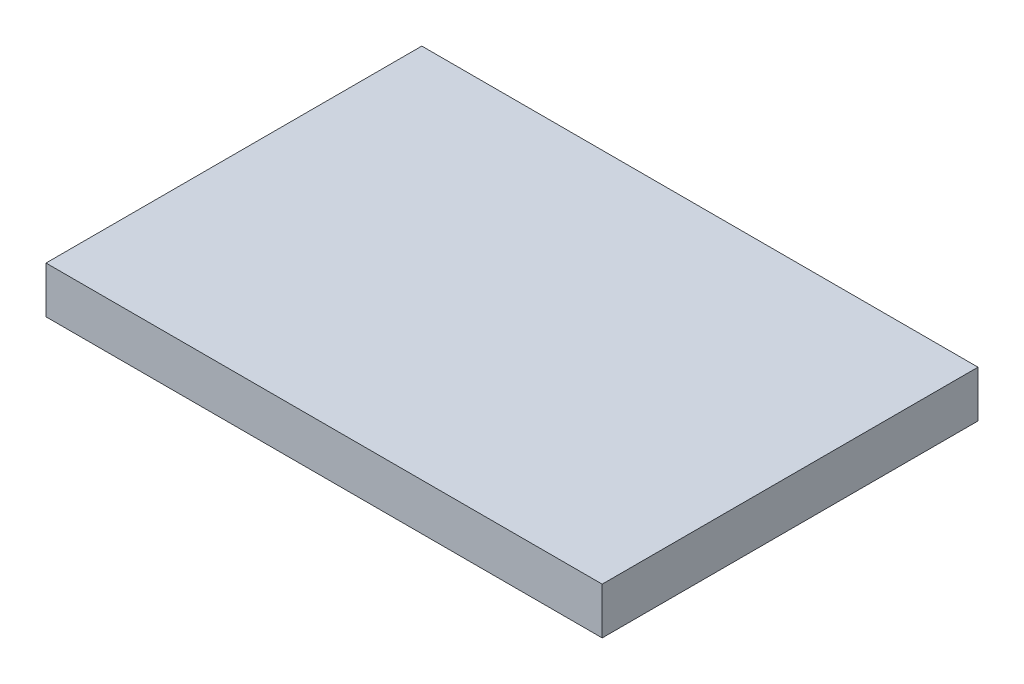
ISO-10303-21;
HEADER;
FILE_DESCRIPTION(('STEP AP214'),'2;1');
FILE_NAME('part.step','',(''),(''),'','','');
FILE_SCHEMA(('AUTOMOTIVE_DESIGN { 1 0 10303 214 1 1 1 1 }'));
ENDSEC;
DATA;
#1=APPLICATION_CONTEXT('core data for automotive mechanical design processes');
#2=APPLICATION_PROTOCOL_DEFINITION('international standard','automotive_design',2000,#1);
#3=PRODUCT_CONTEXT('',#1,'mechanical');
#4=PRODUCT('Part','Part','',(#3));
#5=PRODUCT_RELATED_PRODUCT_CATEGORY('part','',(#4));
#6=PRODUCT_DEFINITION_FORMATION('','',#4);
#7=PRODUCT_DEFINITION_CONTEXT('part definition',#1,'design');
#8=PRODUCT_DEFINITION('design','',#6,#7);
#9=PRODUCT_DEFINITION_SHAPE('','',#8);
#10=(LENGTH_UNIT() NAMED_UNIT(*) SI_UNIT(.MILLI.,.METRE.));
#11=(NAMED_UNIT(*) PLANE_ANGLE_UNIT() SI_UNIT($,.RADIAN.));
#12=(NAMED_UNIT(*) SI_UNIT($,.STERADIAN.) SOLID_ANGLE_UNIT());
#13=UNCERTAINTY_MEASURE_WITH_UNIT(LENGTH_MEASURE(1.E-05),#10,'distance_accuracy_value','');
#14=(GEOMETRIC_REPRESENTATION_CONTEXT(3) GLOBAL_UNCERTAINTY_ASSIGNED_CONTEXT((#13)) GLOBAL_UNIT_ASSIGNED_CONTEXT((#10,
#11,#12)) REPRESENTATION_CONTEXT('',''));
#15=CARTESIAN_POINT('',(0.,0.,0.));
#16=DIRECTION('',(0.,0.,1.));
#17=DIRECTION('',(1.,0.,0.));
#18=AXIS2_PLACEMENT_3D('',#15,#16,#17);
#19=CARTESIAN_POINT('',(-92.5,15.5,62.5));
#20=DIRECTION('',(1.,0.,0.));
#21=DIRECTION('',(0.,0.,-1.));
#22=AXIS2_PLACEMENT_3D('',#19,#20,#21);
#23=PLANE('',#22);
#24=DIRECTION('',(0.,0.,1.));
#25=VECTOR('',#24,1.);
#26=CARTESIAN_POINT('',(-92.5,0.,62.5));
#27=LINE('',#26,#25);
#28=CARTESIAN_POINT('',(-92.5,0.,-62.5));
#29=VERTEX_POINT('',#28);
#30=CARTESIAN_POINT('',(-92.5,0.,62.5));
#31=VERTEX_POINT('',#30);
#32=EDGE_CURVE('E96',#29,#31,#27,.T.);
#33=ORIENTED_EDGE('',*,*,#32,.T.);
#34=DIRECTION('',(0.,-1.,0.));
#35=VECTOR('',#34,1.);
#36=CARTESIAN_POINT('',(-92.5,15.5,62.5));
#37=LINE('',#36,#35);
#38=CARTESIAN_POINT('',(-92.5,15.5,62.5));
#39=VERTEX_POINT('',#38);
#40=EDGE_CURVE('E11',#39,#31,#37,.T.);
#41=ORIENTED_EDGE('',*,*,#40,.F.);
#42=DIRECTION('',(0.,0.,1.));
#43=VECTOR('',#42,1.);
#44=CARTESIAN_POINT('',(-92.5,15.5,62.5));
#45=LINE('',#44,#43);
#46=CARTESIAN_POINT('',(-92.5,15.5,-62.5));
#47=VERTEX_POINT('',#46);
#48=EDGE_CURVE('E84',#47,#39,#45,.T.);
#49=ORIENTED_EDGE('',*,*,#48,.F.);
#50=DIRECTION('',(0.,-1.,0.));
#51=VECTOR('',#50,1.);
#52=CARTESIAN_POINT('',(-92.5,15.5,-62.5));
#53=LINE('',#52,#51);
#54=EDGE_CURVE('E92',#47,#29,#53,.T.);
#55=ORIENTED_EDGE('',*,*,#54,.T.);
#56=EDGE_LOOP('',(#33,#41,#49,#55));
#57=FACE_BOUND('',#56,.T.);
#58=ADVANCED_FACE('F33',(#57),#23,.F.);
#59=CARTESIAN_POINT('',(92.5,15.5,62.5));
#60=DIRECTION('',(0.,0.,-1.));
#61=DIRECTION('',(-1.,0.,0.));
#62=AXIS2_PLACEMENT_3D('',#59,#60,#61);
#63=PLANE('',#62);
#64=DIRECTION('',(1.,0.,0.));
#65=VECTOR('',#64,1.);
#66=CARTESIAN_POINT('',(92.5,0.,62.5));
#67=LINE('',#66,#65);
#68=CARTESIAN_POINT('',(92.5,0.,62.5));
#69=VERTEX_POINT('',#68);
#70=EDGE_CURVE('E88',#31,#69,#67,.T.);
#71=ORIENTED_EDGE('',*,*,#70,.T.);
#72=DIRECTION('',(0.,-1.,0.));
#73=VECTOR('',#72,1.);
#74=CARTESIAN_POINT('',(92.5,15.5,62.5));
#75=LINE('',#74,#73);
#76=CARTESIAN_POINT('',(92.5,15.5,62.5));
#77=VERTEX_POINT('',#76);
#78=EDGE_CURVE('E41',#77,#69,#75,.T.);
#79=ORIENTED_EDGE('',*,*,#78,.F.);
#80=DIRECTION('',(1.,0.,0.));
#81=VECTOR('',#80,1.);
#82=CARTESIAN_POINT('',(92.5,15.5,62.5));
#83=LINE('',#82,#81);
#84=EDGE_CURVE('E79',#39,#77,#83,.T.);
#85=ORIENTED_EDGE('',*,*,#84,.F.);
#86=ORIENTED_EDGE('',*,*,#40,.T.);
#87=EDGE_LOOP('',(#71,#79,#85,#86));
#88=FACE_BOUND('',#87,.T.);
#89=ADVANCED_FACE('F87',(#88),#63,.F.);
#90=CARTESIAN_POINT('',(92.5,15.5,62.5));
#91=DIRECTION('',(-1.,0.,0.));
#92=DIRECTION('',(0.,0.,1.));
#93=AXIS2_PLACEMENT_3D('',#90,#91,#92);
#94=PLANE('',#93);
#95=DIRECTION('',(0.,0.,-1.));
#96=VECTOR('',#95,1.);
#97=CARTESIAN_POINT('',(92.5,0.,62.5));
#98=LINE('',#97,#96);
#99=CARTESIAN_POINT('',(92.5,0.,-62.5));
#100=VERTEX_POINT('',#99);
#101=EDGE_CURVE('E66',#69,#100,#98,.T.);
#102=ORIENTED_EDGE('',*,*,#101,.T.);
#103=DIRECTION('',(0.,-1.,0.));
#104=VECTOR('',#103,1.);
#105=CARTESIAN_POINT('',(92.5,15.5,-62.5));
#106=LINE('',#105,#104);
#107=CARTESIAN_POINT('',(92.5,15.5,-62.5));
#108=VERTEX_POINT('',#107);
#109=EDGE_CURVE('E89',#108,#100,#106,.T.);
#110=ORIENTED_EDGE('',*,*,#109,.F.);
#111=DIRECTION('',(0.,0.,-1.));
#112=VECTOR('',#111,1.);
#113=CARTESIAN_POINT('',(92.5,15.5,62.5));
#114=LINE('',#113,#112);
#115=EDGE_CURVE('E82',#77,#108,#114,.T.);
#116=ORIENTED_EDGE('',*,*,#115,.F.);
#117=ORIENTED_EDGE('',*,*,#78,.T.);
#118=EDGE_LOOP('',(#102,#110,#116,#117));
#119=FACE_BOUND('',#118,.T.);
#120=ADVANCED_FACE('F90',(#119),#94,.F.);
#121=CARTESIAN_POINT('',(92.5,15.5,-62.5));
#122=DIRECTION('',(0.,0.,1.));
#123=DIRECTION('',(1.,0.,0.));
#124=AXIS2_PLACEMENT_3D('',#121,#122,#123);
#125=PLANE('',#124);
#126=DIRECTION('',(-1.,0.,0.));
#127=VECTOR('',#126,1.);
#128=CARTESIAN_POINT('',(92.5,0.,-62.5));
#129=LINE('',#128,#127);
#130=EDGE_CURVE('E72',#100,#29,#129,.T.);
#131=ORIENTED_EDGE('',*,*,#130,.T.);
#132=ORIENTED_EDGE('',*,*,#54,.F.);
#133=DIRECTION('',(-1.,0.,0.));
#134=VECTOR('',#133,1.);
#135=CARTESIAN_POINT('',(92.5,15.5,-62.5));
#136=LINE('',#135,#134);
#137=EDGE_CURVE('E49',#108,#47,#136,.T.);
#138=ORIENTED_EDGE('',*,*,#137,.F.);
#139=ORIENTED_EDGE('',*,*,#109,.T.);
#140=EDGE_LOOP('',(#131,#132,#138,#139));
#141=FACE_BOUND('',#140,.T.);
#142=ADVANCED_FACE('F103',(#141),#125,.F.);
#143=CARTESIAN_POINT('',(0.,15.5,0.));
#144=DIRECTION('',(0.,1.,0.));
#145=DIRECTION('',(0.,0.,1.));
#146=AXIS2_PLACEMENT_3D('',#143,#144,#145);
#147=PLANE('',#146);
#148=ORIENTED_EDGE('',*,*,#48,.T.);
#149=ORIENTED_EDGE('',*,*,#84,.T.);
#150=ORIENTED_EDGE('',*,*,#115,.T.);
#151=ORIENTED_EDGE('',*,*,#137,.T.);
#152=EDGE_LOOP('',(#148,#149,#150,#151));
#153=FACE_BOUND('',#152,.T.);
#154=ADVANCED_FACE('F80',(#153),#147,.T.);
#155=CARTESIAN_POINT('',(0.,0.,0.));
#156=DIRECTION('',(0.,1.,0.));
#157=DIRECTION('',(0.,0.,1.));
#158=AXIS2_PLACEMENT_3D('',#155,#156,#157);
#159=PLANE('',#158);
#160=ORIENTED_EDGE('',*,*,#32,.F.);
#161=ORIENTED_EDGE('',*,*,#130,.F.);
#162=ORIENTED_EDGE('',*,*,#101,.F.);
#163=ORIENTED_EDGE('',*,*,#70,.F.);
#164=EDGE_LOOP('',(#160,#161,#162,#163));
#165=FACE_BOUND('',#164,.T.);
#166=ADVANCED_FACE('F106',(#165),#159,.F.);
#167=CLOSED_SHELL('',(#58,#89,#120,#142,#154,#166));
#168=MANIFOLD_SOLID_BREP('B2',#167);
#169=ADVANCED_BREP_SHAPE_REPRESENTATION('',(#18,#168),#14);
#170=SHAPE_DEFINITION_REPRESENTATION(#9,#169);
ENDSEC;
END-ISO-10303-21;
